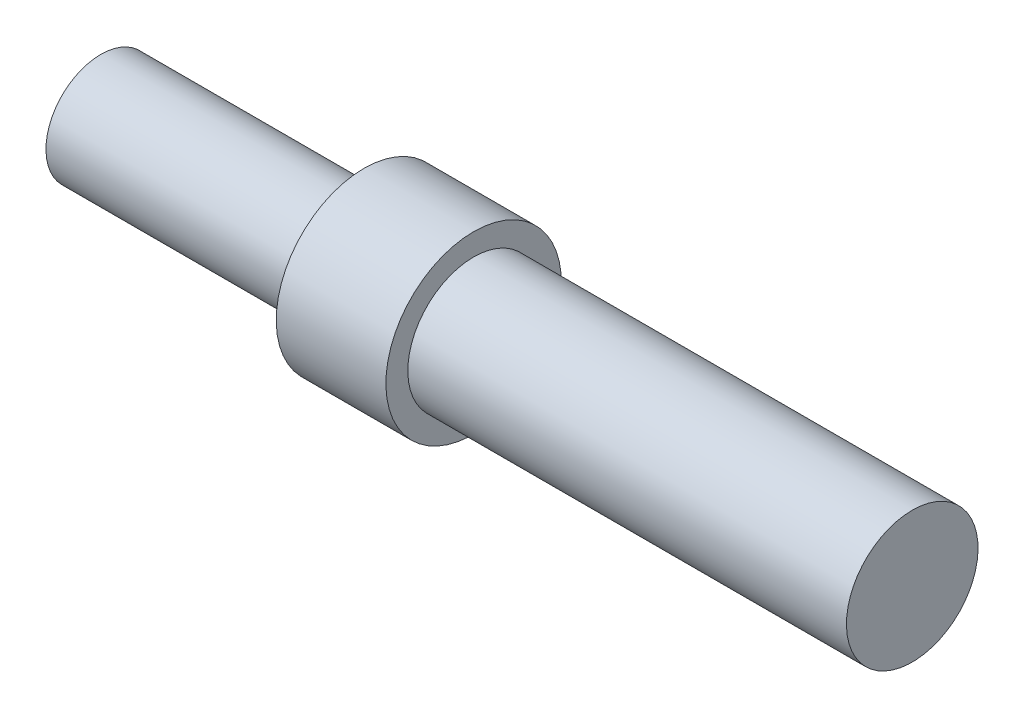
ISO-10303-21;
HEADER;
FILE_DESCRIPTION(('STEP AP214'),'2;1');
FILE_NAME('part.step','',(''),(''),'','','');
FILE_SCHEMA(('AUTOMOTIVE_DESIGN { 1 0 10303 214 1 1 1 1 }'));
ENDSEC;
DATA;
#1=APPLICATION_CONTEXT('core data for automotive mechanical design processes');
#2=APPLICATION_PROTOCOL_DEFINITION('international standard','automotive_design',2000,#1);
#3=PRODUCT_CONTEXT('',#1,'mechanical');
#4=PRODUCT('Part','Part','',(#3));
#5=PRODUCT_RELATED_PRODUCT_CATEGORY('part','',(#4));
#6=PRODUCT_DEFINITION_FORMATION('','',#4);
#7=PRODUCT_DEFINITION_CONTEXT('part definition',#1,'design');
#8=PRODUCT_DEFINITION('design','',#6,#7);
#9=PRODUCT_DEFINITION_SHAPE('','',#8);
#10=(LENGTH_UNIT() NAMED_UNIT(*) SI_UNIT(.MILLI.,.METRE.));
#11=(NAMED_UNIT(*) PLANE_ANGLE_UNIT() SI_UNIT($,.RADIAN.));
#12=(NAMED_UNIT(*) SI_UNIT($,.STERADIAN.) SOLID_ANGLE_UNIT());
#13=UNCERTAINTY_MEASURE_WITH_UNIT(LENGTH_MEASURE(1.E-05),#10,'distance_accuracy_value','');
#14=(GEOMETRIC_REPRESENTATION_CONTEXT(3) GLOBAL_UNCERTAINTY_ASSIGNED_CONTEXT((#13)) GLOBAL_UNIT_ASSIGNED_CONTEXT((#10,
#11,#12)) REPRESENTATION_CONTEXT('',''));
#15=CARTESIAN_POINT('',(0.,0.,0.));
#16=DIRECTION('',(0.,0.,1.));
#17=DIRECTION('',(1.,0.,0.));
#18=AXIS2_PLACEMENT_3D('',#15,#16,#17);
#19=CARTESIAN_POINT('',(0.,0.,0.));
#20=DIRECTION('',(-1.,0.,0.));
#21=DIRECTION('',(0.,-1.,0.));
#22=AXIS2_PLACEMENT_3D('',#19,#20,#21);
#23=PLANE('',#22);
#24=CARTESIAN_POINT('',(0.,0.,0.));
#25=DIRECTION('',(1.,0.,0.));
#26=DIRECTION('',(0.,1.,0.));
#27=AXIS2_PLACEMENT_3D('',#24,#25,#26);
#28=CIRCLE('',#27,1.25);
#29=CARTESIAN_POINT('',(0.,1.25,0.));
#30=VERTEX_POINT('',#29);
#31=EDGE_CURVE('E10',#30,#30,#28,.T.);
#32=ORIENTED_EDGE('',*,*,#31,.F.);
#33=EDGE_LOOP('',(#32));
#34=FACE_BOUND('',#33,.T.);
#35=ADVANCED_FACE('F33',(#34),#23,.T.);
#36=CARTESIAN_POINT('',(18.5,0.,0.));
#37=DIRECTION('',(1.,0.,0.));
#38=DIRECTION('',(0.,1.,0.));
#39=AXIS2_PLACEMENT_3D('',#36,#37,#38);
#40=CYLINDRICAL_SURFACE('',#39,1.25);
#41=ORIENTED_EDGE('',*,*,#31,.T.);
#42=EDGE_LOOP('',(#41));
#43=FACE_BOUND('',#42,.T.);
#44=CARTESIAN_POINT('',(6.,0.,0.));
#45=DIRECTION('',(1.,0.,0.));
#46=DIRECTION('',(0.,1.,0.));
#47=AXIS2_PLACEMENT_3D('',#44,#45,#46);
#48=CIRCLE('',#47,1.25);
#49=CARTESIAN_POINT('',(6.,1.25,0.));
#50=VERTEX_POINT('',#49);
#51=EDGE_CURVE('E39',#50,#50,#48,.T.);
#52=ORIENTED_EDGE('',*,*,#51,.F.);
#53=EDGE_LOOP('',(#52));
#54=FACE_BOUND('',#53,.T.);
#55=ADVANCED_FACE('F75',(#43,#54),#40,.T.);
#56=CARTESIAN_POINT('',(6.,1.25,0.));
#57=DIRECTION('',(-1.,0.,0.));
#58=DIRECTION('',(0.,-1.,0.));
#59=AXIS2_PLACEMENT_3D('',#56,#57,#58);
#60=PLANE('',#59);
#61=ORIENTED_EDGE('',*,*,#51,.T.);
#62=EDGE_LOOP('',(#61));
#63=FACE_BOUND('',#62,.T.);
#64=CARTESIAN_POINT('',(6.,0.,0.));
#65=DIRECTION('',(1.,0.,0.));
#66=DIRECTION('',(0.,1.,0.));
#67=AXIS2_PLACEMENT_3D('',#64,#65,#66);
#68=CIRCLE('',#67,2.);
#69=CARTESIAN_POINT('',(6.,2.,0.));
#70=VERTEX_POINT('',#69);
#71=EDGE_CURVE('E43',#70,#70,#68,.T.);
#72=ORIENTED_EDGE('',*,*,#71,.F.);
#73=EDGE_LOOP('',(#72));
#74=FACE_BOUND('',#73,.T.);
#75=ADVANCED_FACE('F80',(#63,#74),#60,.T.);
#76=CARTESIAN_POINT('',(18.5,0.,0.));
#77=DIRECTION('',(1.,0.,0.));
#78=DIRECTION('',(0.,1.,0.));
#79=AXIS2_PLACEMENT_3D('',#76,#77,#78);
#80=CYLINDRICAL_SURFACE('',#79,2.);
#81=ORIENTED_EDGE('',*,*,#71,.T.);
#82=EDGE_LOOP('',(#81));
#83=FACE_BOUND('',#82,.T.);
#84=CARTESIAN_POINT('',(8.5,0.,0.));
#85=DIRECTION('',(1.,0.,0.));
#86=DIRECTION('',(0.,1.,0.));
#87=AXIS2_PLACEMENT_3D('',#84,#85,#86);
#88=CIRCLE('',#87,2.);
#89=CARTESIAN_POINT('',(8.5,2.,0.));
#90=VERTEX_POINT('',#89);
#91=EDGE_CURVE('E47',#90,#90,#88,.T.);
#92=ORIENTED_EDGE('',*,*,#91,.F.);
#93=EDGE_LOOP('',(#92));
#94=FACE_BOUND('',#93,.T.);
#95=ADVANCED_FACE('F71',(#83,#94),#80,.T.);
#96=CARTESIAN_POINT('',(8.5,2.,0.));
#97=DIRECTION('',(1.,0.,0.));
#98=DIRECTION('',(0.,1.,0.));
#99=AXIS2_PLACEMENT_3D('',#96,#97,#98);
#100=PLANE('',#99);
#101=ORIENTED_EDGE('',*,*,#91,.T.);
#102=EDGE_LOOP('',(#101));
#103=FACE_BOUND('',#102,.T.);
#104=CARTESIAN_POINT('',(8.5,0.,0.));
#105=DIRECTION('',(1.,0.,0.));
#106=DIRECTION('',(0.,1.,0.));
#107=AXIS2_PLACEMENT_3D('',#104,#105,#106);
#108=CIRCLE('',#107,1.5);
#109=CARTESIAN_POINT('',(8.5,1.5,0.));
#110=VERTEX_POINT('',#109);
#111=EDGE_CURVE('E52',#110,#110,#108,.T.);
#112=ORIENTED_EDGE('',*,*,#111,.F.);
#113=EDGE_LOOP('',(#112));
#114=FACE_BOUND('',#113,.T.);
#115=ADVANCED_FACE('F63',(#103,#114),#100,.T.);
#116=CARTESIAN_POINT('',(18.5,0.,0.));
#117=DIRECTION('',(1.,0.,0.));
#118=DIRECTION('',(0.,1.,0.));
#119=AXIS2_PLACEMENT_3D('',#116,#117,#118);
#120=CYLINDRICAL_SURFACE('',#119,1.5);
#121=ORIENTED_EDGE('',*,*,#111,.T.);
#122=EDGE_LOOP('',(#121));
#123=FACE_BOUND('',#122,.T.);
#124=CARTESIAN_POINT('',(18.5,0.,0.));
#125=DIRECTION('',(1.,0.,0.));
#126=DIRECTION('',(0.,1.,0.));
#127=AXIS2_PLACEMENT_3D('',#124,#125,#126);
#128=CIRCLE('',#127,1.5);
#129=CARTESIAN_POINT('',(18.5,1.5,0.));
#130=VERTEX_POINT('',#129);
#131=EDGE_CURVE('E55',#130,#130,#128,.T.);
#132=ORIENTED_EDGE('',*,*,#131,.F.);
#133=EDGE_LOOP('',(#132));
#134=FACE_BOUND('',#133,.T.);
#135=ADVANCED_FACE('F61',(#123,#134),#120,.T.);
#136=CARTESIAN_POINT('',(18.5,1.5,0.));
#137=DIRECTION('',(1.,0.,0.));
#138=DIRECTION('',(0.,1.,0.));
#139=AXIS2_PLACEMENT_3D('',#136,#137,#138);
#140=PLANE('',#139);
#141=ORIENTED_EDGE('',*,*,#131,.T.);
#142=EDGE_LOOP('',(#141));
#143=FACE_BOUND('',#142,.T.);
#144=ADVANCED_FACE('F59',(#143),#140,.T.);
#145=CLOSED_SHELL('',(#35,#55,#75,#95,#115,#135,#144));
#146=MANIFOLD_SOLID_BREP('B2',#145);
#147=ADVANCED_BREP_SHAPE_REPRESENTATION('',(#18,#146),#14);
#148=SHAPE_DEFINITION_REPRESENTATION(#9,#147);
ENDSEC;
END-ISO-10303-21;
